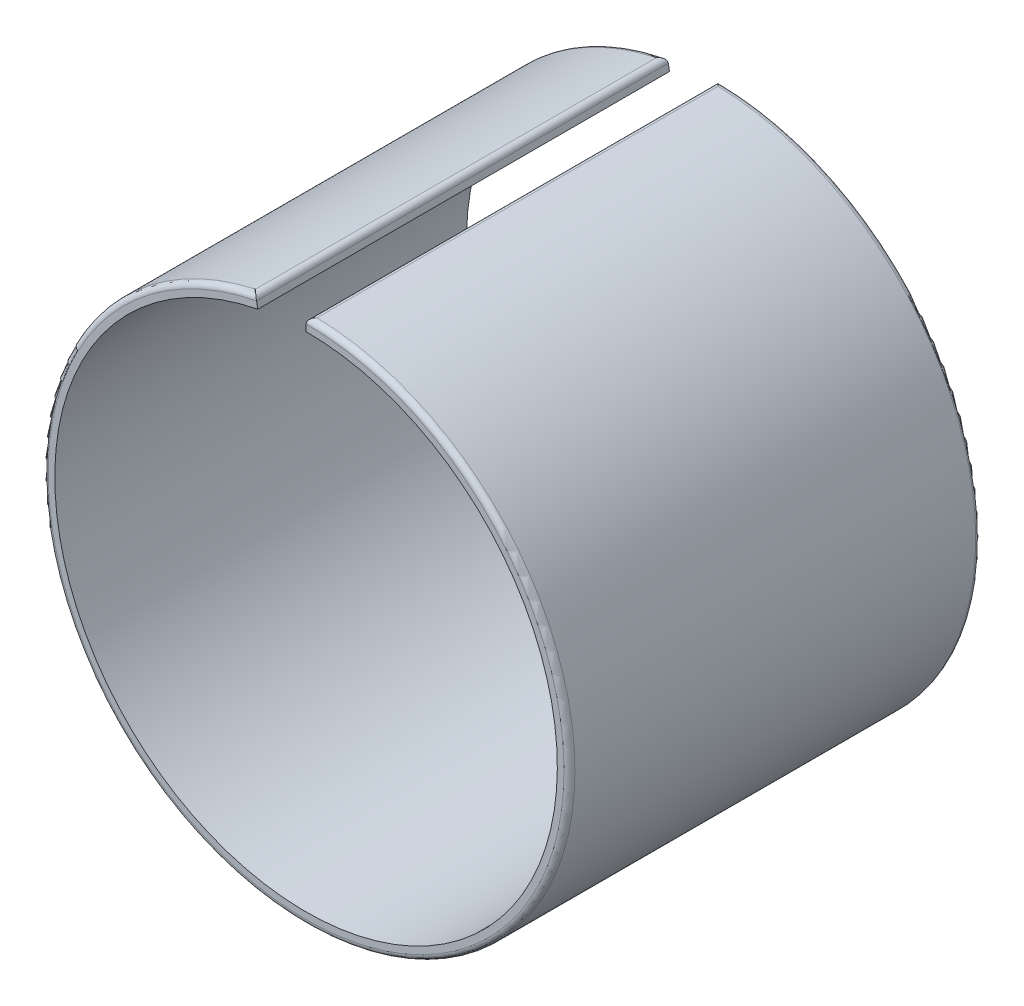
ISO-10303-21;
HEADER;
FILE_DESCRIPTION(('STEP AP214'),'2;1');
FILE_NAME('part.step','',(''),(''),'','','');
FILE_SCHEMA(('AUTOMOTIVE_DESIGN { 1 0 10303 214 1 1 1 1 }'));
ENDSEC;
DATA;
#1=APPLICATION_CONTEXT('core data for automotive mechanical design processes');
#2=APPLICATION_PROTOCOL_DEFINITION('international standard','automotive_design',2000,#1);
#3=PRODUCT_CONTEXT('',#1,'mechanical');
#4=PRODUCT('Part','Part','',(#3));
#5=PRODUCT_RELATED_PRODUCT_CATEGORY('part','',(#4));
#6=PRODUCT_DEFINITION_FORMATION('','',#4);
#7=PRODUCT_DEFINITION_CONTEXT('part definition',#1,'design');
#8=PRODUCT_DEFINITION('design','',#6,#7);
#9=PRODUCT_DEFINITION_SHAPE('','',#8);
#10=(LENGTH_UNIT() NAMED_UNIT(*) SI_UNIT(.MILLI.,.METRE.));
#11=(NAMED_UNIT(*) PLANE_ANGLE_UNIT() SI_UNIT($,.RADIAN.));
#12=(NAMED_UNIT(*) SI_UNIT($,.STERADIAN.) SOLID_ANGLE_UNIT());
#13=UNCERTAINTY_MEASURE_WITH_UNIT(LENGTH_MEASURE(1.E-05),#10,'distance_accuracy_value','');
#14=(GEOMETRIC_REPRESENTATION_CONTEXT(3) GLOBAL_UNCERTAINTY_ASSIGNED_CONTEXT((#13)) GLOBAL_UNIT_ASSIGNED_CONTEXT((#10,
#11,#12)) REPRESENTATION_CONTEXT('',''));
#15=CARTESIAN_POINT('',(0.,0.,0.));
#16=DIRECTION('',(0.,0.,1.));
#17=DIRECTION('',(1.,0.,0.));
#18=AXIS2_PLACEMENT_3D('',#15,#16,#17);
#19=CARTESIAN_POINT('',(0.,0.,34.));
#20=DIRECTION('',(0.,0.,-1.));
#21=DIRECTION('',(-1.,0.,0.));
#22=AXIS2_PLACEMENT_3D('',#19,#20,#21);
#23=CYLINDRICAL_SURFACE('',#22,20.75);
#24=CARTESIAN_POINT('',(0.,0.,0.));
#25=DIRECTION('',(0.,0.,-1.));
#26=DIRECTION('',(1.,0.,0.));
#27=AXIS2_PLACEMENT_3D('',#24,#25,#26);
#28=CIRCLE('',#27,20.75);
#29=CARTESIAN_POINT('',(0.,20.75,0.));
#30=VERTEX_POINT('',#29);
#31=CARTESIAN_POINT('',(-3.98137629924296,20.3644578313253,0.));
#32=VERTEX_POINT('',#31);
#33=EDGE_CURVE('E121',#30,#32,#28,.T.);
#34=ORIENTED_EDGE('',*,*,#33,.T.);
#35=DIRECTION('',(0.,0.,-1.));
#36=VECTOR('',#35,1.);
#37=CARTESIAN_POINT('',(-3.98137629924296,20.3644578313253,34.));
#38=LINE('',#37,#36);
#39=CARTESIAN_POINT('',(-3.98137629924296,20.3644578313253,34.));
#40=VERTEX_POINT('',#39);
#41=EDGE_CURVE('E105',#40,#32,#38,.T.);
#42=ORIENTED_EDGE('',*,*,#41,.F.);
#43=CARTESIAN_POINT('',(0.,0.,34.));
#44=DIRECTION('',(0.,0.,-1.));
#45=DIRECTION('',(1.,0.,0.));
#46=AXIS2_PLACEMENT_3D('',#43,#44,#45);
#47=CIRCLE('',#46,20.75);
#48=CARTESIAN_POINT('',(0.,20.75,34.));
#49=VERTEX_POINT('',#48);
#50=EDGE_CURVE('E110',#49,#40,#47,.T.);
#51=ORIENTED_EDGE('',*,*,#50,.F.);
#52=DIRECTION('',(0.,0.,-1.));
#53=VECTOR('',#52,1.);
#54=CARTESIAN_POINT('',(0.,20.75,34.));
#55=LINE('',#54,#53);
#56=EDGE_CURVE('E123',#49,#30,#55,.T.);
#57=ORIENTED_EDGE('',*,*,#56,.T.);
#58=EDGE_LOOP('',(#34,#42,#51,#57));
#59=FACE_BOUND('',#58,.T.);
#60=ADVANCED_FACE('F32',(#59),#23,.F.);
#61=CARTESIAN_POINT('',(-3.98137629924296,20.3644578313253,34.));
#62=DIRECTION('',(-0.981419654521701,-0.191873556590023,0.));
#63=DIRECTION('',(0.191873556590023,-0.981419654521701,0.));
#64=AXIS2_PLACEMENT_3D('',#61,#62,#63);
#65=PLANE('',#64);
#66=DIRECTION('',(-0.191873556590023,0.981419654521701,0.));
#67=VECTOR('',#66,1.);
#68=CARTESIAN_POINT('',(-3.98137629924296,20.3644578313253,0.));
#69=LINE('',#68,#67);
#70=CARTESIAN_POINT('',(-4.08599457856595,20.8995729215678,0.));
#71=VERTEX_POINT('',#70);
#72=EDGE_CURVE('E197',#32,#71,#69,.T.);
#73=ORIENTED_EDGE('',*,*,#72,.T.);
#74=DIRECTION('',(0.,0.,-1.));
#75=VECTOR('',#74,1.);
#76=CARTESIAN_POINT('',(-4.08599457856595,20.8995729215678,34.));
#77=LINE('',#76,#75);
#78=CARTESIAN_POINT('',(-4.08599457856595,20.8995729215678,34.));
#79=VERTEX_POINT('',#78);
#80=EDGE_CURVE('E108',#71,#79,#77,.F.);
#81=ORIENTED_EDGE('',*,*,#80,.T.);
#82=DIRECTION('',(-0.191873556590023,0.981419654521701,0.));
#83=VECTOR('',#82,1.);
#84=CARTESIAN_POINT('',(-3.98137629924296,20.3644578313253,34.));
#85=LINE('',#84,#83);
#86=EDGE_CURVE('E100',#40,#79,#85,.T.);
#87=ORIENTED_EDGE('',*,*,#86,.F.);
#88=ORIENTED_EDGE('',*,*,#41,.T.);
#89=EDGE_LOOP('',(#73,#81,#87,#88));
#90=FACE_BOUND('',#89,.T.);
#91=ADVANCED_FACE('F103',(#90),#65,.F.);
#92=CARTESIAN_POINT('',(0.,0.,34.));
#93=DIRECTION('',(0.,0.,-1.));
#94=DIRECTION('',(-1.,0.,0.));
#95=AXIS2_PLACEMENT_3D('',#92,#93,#94);
#96=CYLINDRICAL_SURFACE('',#95,21.75);
#97=CARTESIAN_POINT('',(0.,0.,33.55));
#98=DIRECTION('',(0.,0.,1.));
#99=DIRECTION('',(1.,0.,0.));
#100=AXIS2_PLACEMENT_3D('',#97,#98,#99);
#101=CIRCLE('',#100,21.75);
#102=CARTESIAN_POINT('',(0.459507042253521,21.7451455106219,33.55));
#103=VERTEX_POINT('',#102);
#104=CARTESIAN_POINT('',(-4.62328765034932,21.2529459440833,33.55));
#105=VERTEX_POINT('',#104);
#106=EDGE_CURVE('E131',#103,#105,#101,.F.);
#107=ORIENTED_EDGE('',*,*,#106,.T.);
#108=DIRECTION('',(0.,0.,-1.));
#109=VECTOR('',#108,1.);
#110=CARTESIAN_POINT('',(-4.62328765034932,21.2529459440833,34.));
#111=LINE('',#110,#109);
#112=CARTESIAN_POINT('',(-4.62328765034932,21.2529459440833,0.449999999999999));
#113=VERTEX_POINT('',#112);
#114=EDGE_CURVE('E133',#105,#113,#111,.T.);
#115=ORIENTED_EDGE('',*,*,#114,.T.);
#116=CARTESIAN_POINT('',(0.,0.,0.449999999999999));
#117=DIRECTION('',(0.,0.,1.));
#118=DIRECTION('',(1.,0.,0.));
#119=AXIS2_PLACEMENT_3D('',#116,#117,#118);
#120=CIRCLE('',#119,21.75);
#121=CARTESIAN_POINT('',(0.459507042253521,21.7451455106219,0.449999999999999));
#122=VERTEX_POINT('',#121);
#123=EDGE_CURVE('E122',#113,#122,#120,.T.);
#124=ORIENTED_EDGE('',*,*,#123,.T.);
#125=DIRECTION('',(0.,0.,-1.));
#126=VECTOR('',#125,1.);
#127=CARTESIAN_POINT('',(0.459507042253521,21.7451455106219,34.));
#128=LINE('',#127,#126);
#129=EDGE_CURVE('E125',#122,#103,#128,.F.);
#130=ORIENTED_EDGE('',*,*,#129,.T.);
#131=EDGE_LOOP('',(#107,#115,#124,#130));
#132=FACE_BOUND('',#131,.T.);
#133=ADVANCED_FACE('F203',(#132),#96,.T.);
#134=CARTESIAN_POINT('',(0.,20.75,34.));
#135=DIRECTION('',(1.,0.,0.));
#136=DIRECTION('',(0.,0.,-1.));
#137=AXIS2_PLACEMENT_3D('',#134,#135,#136);
#138=PLANE('',#137);
#139=DIRECTION('',(0.,-1.,0.));
#140=VECTOR('',#139,1.);
#141=CARTESIAN_POINT('',(0.,20.75,34.));
#142=LINE('',#141,#140);
#143=CARTESIAN_POINT('',(0.,21.2952459483332,34.));
#144=VERTEX_POINT('',#143);
#145=EDGE_CURVE('E109',#144,#49,#142,.T.);
#146=ORIENTED_EDGE('',*,*,#145,.F.);
#147=DIRECTION('',(0.,0.,-1.));
#148=VECTOR('',#147,1.);
#149=CARTESIAN_POINT('',(0.,21.2952459483332,34.));
#150=LINE('',#149,#148);
#151=CARTESIAN_POINT('',(0.,21.2952459483332,0.));
#152=VERTEX_POINT('',#151);
#153=EDGE_CURVE('E11',#144,#152,#150,.T.);
#154=ORIENTED_EDGE('',*,*,#153,.T.);
#155=DIRECTION('',(0.,-1.,0.));
#156=VECTOR('',#155,1.);
#157=CARTESIAN_POINT('',(0.,20.75,0.));
#158=LINE('',#157,#156);
#159=EDGE_CURVE('E118',#152,#30,#158,.T.);
#160=ORIENTED_EDGE('',*,*,#159,.T.);
#161=ORIENTED_EDGE('',*,*,#56,.F.);
#162=EDGE_LOOP('',(#146,#154,#160,#161));
#163=FACE_BOUND('',#162,.T.);
#164=ADVANCED_FACE('F192',(#163),#138,.F.);
#165=CARTESIAN_POINT('',(0.,0.,34.));
#166=DIRECTION('',(0.,0.,1.));
#167=DIRECTION('',(1.,0.,0.));
#168=AXIS2_PLACEMENT_3D('',#165,#166,#167);
#169=PLANE('',#168);
#170=ORIENTED_EDGE('',*,*,#86,.T.);
#171=CARTESIAN_POINT('',(-4.52763342310071,20.8132298211023,34.));
#172=DIRECTION('',(0.,0.,1.));
#173=DIRECTION('',(1.,0.,0.));
#174=AXIS2_PLACEMENT_3D('',#171,#172,#173);
#175=CIRCLE('',#174,0.45);
#176=CARTESIAN_POINT('',(-4.08693140168856,20.9042338227903,34.));
#177=VERTEX_POINT('',#176);
#178=EDGE_CURVE('E46',#79,#177,#175,.T.);
#179=ORIENTED_EDGE('',*,*,#178,.T.);
#180=CARTESIAN_POINT('',(0.,0.,34.));
#181=DIRECTION('',(0.,0.,1.));
#182=DIRECTION('',(1.,0.,0.));
#183=AXIS2_PLACEMENT_3D('',#180,#181,#182);
#184=CIRCLE('',#183,21.3);
#185=CARTESIAN_POINT('',(2.51129308550044E-05,21.2999999999852,34.));
#186=VERTEX_POINT('',#185);
#187=EDGE_CURVE('E57',#177,#186,#184,.T.);
#188=ORIENTED_EDGE('',*,*,#187,.T.);
#189=CARTESIAN_POINT('',(0.45,21.2952459483332,34.));
#190=DIRECTION('',(0.,0.,1.));
#191=DIRECTION('',(1.,0.,0.));
#192=AXIS2_PLACEMENT_3D('',#189,#190,#191);
#193=CIRCLE('',#192,0.45);
#194=EDGE_CURVE('E143',#186,#144,#193,.T.);
#195=ORIENTED_EDGE('',*,*,#194,.T.);
#196=ORIENTED_EDGE('',*,*,#145,.T.);
#197=ORIENTED_EDGE('',*,*,#50,.T.);
#198=EDGE_LOOP('',(#170,#179,#188,#195,#196,#197));
#199=FACE_BOUND('',#198,.T.);
#200=ADVANCED_FACE('F113',(#199),#169,.T.);
#201=CARTESIAN_POINT('',(0.,0.,0.));
#202=DIRECTION('',(0.,0.,1.));
#203=DIRECTION('',(1.,0.,0.));
#204=AXIS2_PLACEMENT_3D('',#201,#202,#203);
#205=PLANE('',#204);
#206=CARTESIAN_POINT('',(0.,0.,0.));
#207=DIRECTION('',(0.,0.,1.));
#208=DIRECTION('',(1.,0.,0.));
#209=AXIS2_PLACEMENT_3D('',#206,#207,#208);
#210=CIRCLE('',#209,21.3);
#211=CARTESIAN_POINT('',(2.51129308550044E-05,21.2999999999852,0.));
#212=VERTEX_POINT('',#211);
#213=CARTESIAN_POINT('',(-4.08693140168856,20.9042338227903,0.));
#214=VERTEX_POINT('',#213);
#215=EDGE_CURVE('E136',#212,#214,#210,.F.);
#216=ORIENTED_EDGE('',*,*,#215,.T.);
#217=CARTESIAN_POINT('',(-4.52763342310071,20.8132298211023,0.));
#218=DIRECTION('',(0.,0.,1.));
#219=DIRECTION('',(1.,0.,0.));
#220=AXIS2_PLACEMENT_3D('',#217,#218,#219);
#221=CIRCLE('',#220,0.45);
#222=EDGE_CURVE('E140',#214,#71,#221,.F.);
#223=ORIENTED_EDGE('',*,*,#222,.T.);
#224=ORIENTED_EDGE('',*,*,#72,.F.);
#225=ORIENTED_EDGE('',*,*,#33,.F.);
#226=ORIENTED_EDGE('',*,*,#159,.F.);
#227=CARTESIAN_POINT('',(0.45,21.2952459483332,0.));
#228=DIRECTION('',(0.,0.,1.));
#229=DIRECTION('',(1.,0.,0.));
#230=AXIS2_PLACEMENT_3D('',#227,#228,#229);
#231=CIRCLE('',#230,0.45);
#232=EDGE_CURVE('E138',#152,#212,#231,.F.);
#233=ORIENTED_EDGE('',*,*,#232,.T.);
#234=EDGE_LOOP('',(#216,#223,#224,#225,#226,#233));
#235=FACE_BOUND('',#234,.T.);
#236=ADVANCED_FACE('F199',(#235),#205,.F.);
#237=CARTESIAN_POINT('',(0.45,21.2952459483332,34.));
#238=DIRECTION('',(0.,0.,-1.));
#239=DIRECTION('',(-1.,0.,0.));
#240=AXIS2_PLACEMENT_3D('',#237,#238,#239);
#241=CYLINDRICAL_SURFACE('',#240,0.45);
#242=ORIENTED_EDGE('',*,*,#153,.F.);
#243=ORIENTED_EDGE('',*,*,#194,.F.);
#244=CARTESIAN_POINT('',(2.51129308550044E-05,21.2999999999852,34.));
#245=CARTESIAN_POINT('',(0.000205080424269829,21.3202502417731,34.0000334832507));
#246=CARTESIAN_POINT('',(0.00181696299777287,21.3404325359598,33.9986354645026));
#247=CARTESIAN_POINT('',(0.00759872869582896,21.3799045347419,33.9932832073745));
#248=CARTESIAN_POINT('',(0.0117462105791799,21.3992004824243,33.9893513385021));
#249=CARTESIAN_POINT('',(0.0222914549653311,21.4364632335712,33.9792430574387));
#250=CARTESIAN_POINT('',(0.0286828209684085,21.4544336412858,33.9730730237996));
#251=CARTESIAN_POINT('',(0.0433383704814814,21.4888345230947,33.9588677815102));
#252=CARTESIAN_POINT('',(0.0516068146869002,21.5052613716974,33.9508283285247));
#253=CARTESIAN_POINT('',(0.073322530895949,21.5427448700066,33.9296724364376));
#254=CARTESIAN_POINT('',(0.0875070441805964,21.5629597978578,33.915822225454));
#255=CARTESIAN_POINT('',(0.117985588156515,21.5999476155502,33.8860212830595));
#256=CARTESIAN_POINT('',(0.134283520784072,21.6167139865604,33.8700666653931));
#257=CARTESIAN_POINT('',(0.174775451678142,21.6526464586891,33.8303924000465));
#258=CARTESIAN_POINT('',(0.199630294709399,21.6703352894032,33.806012525735));
#259=CARTESIAN_POINT('',(0.250993017452138,21.6999390100549,33.7555778432692));
#260=CARTESIAN_POINT('',(0.277502849498397,21.7118469294308,33.7295210557549));
#261=CARTESIAN_POINT('',(0.329348795924076,21.7295673078622,33.6784988495765));
#262=CARTESIAN_POINT('',(0.35462024895406,21.7357753533961,33.653601737457));
#263=CARTESIAN_POINT('',(0.405436258118273,21.7437698734261,33.603468283826));
#264=CARTESIAN_POINT('',(0.43098013812847,21.7455655032285,33.5782327541458));
#265=CARTESIAN_POINT('',(0.457475905138596,21.7451849877105,33.5520103922595));
#266=CARTESIAN_POINT('',(0.458491531583518,21.7451669655078,33.5510051747432));
#267=CARTESIAN_POINT('',(0.459507042253521,21.7451455106219,33.55));
#268=B_SPLINE_CURVE_WITH_KNOTS('',3,(#244,#245,#246,#247,#248,#249,#250,#251,#252,#253,#254,
#255,#256,#257,#258,#259,#260,#261,#262,#263,#264,#265,#266,#267),.UNSPECIFIED.,.F.,.F.,(4,2,2,
2,2,2,2,2,2,2,2,4),(0.,0.0605732287088322,0.12061889334988,0.180494761096977,0.240507921926082,
0.324980453396992,0.409611225386809,0.526139377937133,0.64280769204515,0.750578928975459,
0.858126362209593,0.862413597700414),.UNSPECIFIED.);
#269=EDGE_CURVE('E37',#103,#186,#268,.F.);
#270=ORIENTED_EDGE('',*,*,#269,.F.);
#271=ORIENTED_EDGE('',*,*,#129,.F.);
#272=CARTESIAN_POINT('',(2.51129308550044E-05,21.2999999999852,0.));
#273=CARTESIAN_POINT('',(0.000205080424270105,21.3202502417731,-3.34832507142784E-05));
#274=CARTESIAN_POINT('',(0.00181696299777311,21.3404325359598,0.00136453549741272));
#275=CARTESIAN_POINT('',(0.00759872869582902,21.3799045347419,0.00671679262545418));
#276=CARTESIAN_POINT('',(0.0117462105791799,21.3992004824243,0.0106486614979461));
#277=CARTESIAN_POINT('',(0.022291454965331,21.4364632335712,0.0207569425612667));
#278=CARTESIAN_POINT('',(0.0286828209684086,21.4544336412858,0.0269269762004245));
#279=CARTESIAN_POINT('',(0.0433383704814815,21.4888345230947,0.0411322184898392));
#280=CARTESIAN_POINT('',(0.0516068146869002,21.5052613716974,0.0491716714752613));
#281=CARTESIAN_POINT('',(0.0733225308959483,21.5427448700066,0.0703275635624218));
#282=CARTESIAN_POINT('',(0.0875070441805947,21.5629597978578,0.0841777745460159));
#283=CARTESIAN_POINT('',(0.117985588156513,21.5999476155502,0.113978716940482));
#284=CARTESIAN_POINT('',(0.13428352078407,21.6167139865604,0.129933334606921));
#285=CARTESIAN_POINT('',(0.174775451678141,21.6526464586891,0.169607599953455));
#286=CARTESIAN_POINT('',(0.1996302947094,21.6703352894032,0.193987474265015));
#287=CARTESIAN_POINT('',(0.250993017452136,21.6999390100549,0.244422156730792));
#288=CARTESIAN_POINT('',(0.27750284949839,21.7118469294308,0.270478944245139));
#289=CARTESIAN_POINT('',(0.329348795924082,21.7295673078622,0.321501150423493));
#290=CARTESIAN_POINT('',(0.354620248954083,21.7357753533961,0.346398262542984));
#291=CARTESIAN_POINT('',(0.405436258118262,21.7437698734261,0.396531716173975));
#292=CARTESIAN_POINT('',(0.430980138128409,21.7455655032285,0.421767245854291));
#293=CARTESIAN_POINT('',(0.457475905138591,21.7451849877105,0.447989607740514));
#294=CARTESIAN_POINT('',(0.458491531583515,21.7451669655078,0.448994825256828));
#295=CARTESIAN_POINT('',(0.459507042253521,21.7451455106219,0.449999999999999));
#296=B_SPLINE_CURVE_WITH_KNOTS('',3,(#272,#273,#274,#275,#276,#277,#278,#279,#280,#281,#282,
#283,#284,#285,#286,#287,#288,#289,#290,#291,#292,#293,#294,#295),.UNSPECIFIED.,.F.,.F.,(4,2,2,
2,2,2,2,2,2,2,2,4),(0.,0.0605732287088322,0.12061889334988,0.180494761096976,0.24050792192608,
0.324980453396989,0.409611225386808,0.526139377937128,0.642807692045149,0.750578928975455,
0.858126362209591,0.862413597700414),.UNSPECIFIED.);
#297=EDGE_CURVE('E170',#212,#122,#296,.T.);
#298=ORIENTED_EDGE('',*,*,#297,.F.);
#299=ORIENTED_EDGE('',*,*,#232,.F.);
#300=EDGE_LOOP('',(#242,#243,#270,#271,#298,#299));
#301=FACE_BOUND('',#300,.T.);
#302=ADVANCED_FACE('F34',(#301),#241,.T.);
#303=CARTESIAN_POINT('',(0.,0.,33.55));
#304=DIRECTION('',(0.,0.,1.));
#305=DIRECTION('',(1.,0.,0.));
#306=AXIS2_PLACEMENT_3D('',#303,#304,#305);
#307=TOROIDAL_SURFACE('',#306,21.3,0.45);
#308=ORIENTED_EDGE('',*,*,#269,.T.);
#309=ORIENTED_EDGE('',*,*,#187,.F.);
#310=CARTESIAN_POINT('',(-4.08693140168856,20.9042338227903,34.));
#311=CARTESIAN_POINT('',(-4.09099351123743,20.9240732770868,34.0000334832507));
#312=CARTESIAN_POINT('',(-4.09644789304158,20.9435712996327,33.9986354645026));
#313=CARTESIAN_POINT('',(-4.10969586432753,20.9812005270929,33.9932832073745));
#314=CARTESIAN_POINT('',(-4.11746866667422,20.9993421573012,33.9893513385021));
#315=CARTESIAN_POINT('',(-4.13496771336741,21.0338892001128,33.9792430574387));
#316=CARTESIAN_POINT('',(-4.14468837162365,21.0502993773172,33.9730730237996));
#317=CARTESIAN_POINT('',(-4.1656722355061,21.0812490664485,33.9588677815102));
#318=CARTESIAN_POINT('',(-4.17693892702658,21.0957842027318,33.9508283285247));
#319=CARTESIAN_POINT('',(-4.20544324986018,21.1284045729898,33.9296724364376));
#320=CARTESIAN_POINT('',(-4.22324292009057,21.1455222674853,33.915822225454));
#321=CARTESIAN_POINT('',(-4.2602521463209,21.1759748121142,33.8860212830595));
#322=CARTESIAN_POINT('',(-4.27946428096651,21.1893025158603,33.8700666653931));
#323=CARTESIAN_POINT('',(-4.32609834901985,21.2167980194491,33.8303924000465));
#324=CARTESIAN_POINT('',(-4.35388539934176,21.2293891984465,33.8060125257349));
#325=CARTESIAN_POINT('',(-4.40997395612111,21.2485877234522,33.7555778432693));
#326=CARTESIAN_POINT('',(-4.43827604117185,21.2551878538129,33.7295210557552));
#327=CARTESIAN_POINT('',(-4.49255874403448,21.2626311153556,33.6784988495762));
#328=CARTESIAN_POINT('',(-4.5185518045118,21.2638748896858,33.653601737456));
#329=CARTESIAN_POINT('',(-4.56995757166323,21.2619706203614,33.603468283827));
#330=CARTESIAN_POINT('',(-4.59537137143707,21.2588316916344,33.5782327541494));
#331=CARTESIAN_POINT('',(-4.62130182707339,21.2533744091761,33.5520103922598));
#332=CARTESIAN_POINT('',(-4.62229512484381,21.253161849974,33.5510051747433));
#333=CARTESIAN_POINT('',(-4.62328765034932,21.2529459440833,33.55));
#334=B_SPLINE_CURVE_WITH_KNOTS('',3,(#310,#311,#312,#313,#314,#315,#316,#317,#318,#319,#320,
#321,#322,#323,#324,#325,#326,#327,#328,#329,#330,#331,#332,#333),.UNSPECIFIED.,.F.,.F.,(4,2,2,
2,2,2,2,2,2,2,2,4),(0.,0.0605732287088325,0.120618893349879,0.180494761096977,0.24050792192608,
0.32498045339699,0.409611225386809,0.526139377937136,0.64280769204515,0.750578928975455,
0.858126362209595,0.862413597700414),.UNSPECIFIED.);
#335=EDGE_CURVE('E155',#105,#177,#334,.F.);
#336=ORIENTED_EDGE('',*,*,#335,.F.);
#337=ORIENTED_EDGE('',*,*,#106,.F.);
#338=EDGE_LOOP('',(#308,#309,#336,#337));
#339=FACE_BOUND('',#338,.T.);
#340=ADVANCED_FACE('F166',(#339),#307,.T.);
#341=CARTESIAN_POINT('',(0.,0.,0.449999999999999));
#342=DIRECTION('',(0.,0.,1.));
#343=DIRECTION('',(1.,0.,0.));
#344=AXIS2_PLACEMENT_3D('',#341,#342,#343);
#345=TOROIDAL_SURFACE('',#344,21.3,0.45);
#346=ORIENTED_EDGE('',*,*,#297,.T.);
#347=ORIENTED_EDGE('',*,*,#123,.F.);
#348=CARTESIAN_POINT('',(-4.08693140168856,20.9042338227903,0.));
#349=CARTESIAN_POINT('',(-4.09099351123743,20.9240732770868,-3.34832507135321E-05));
#350=CARTESIAN_POINT('',(-4.09644789304158,20.9435712996327,0.00136453549741317));
#351=CARTESIAN_POINT('',(-4.10969586432753,20.9812005270929,0.00671679262545383));
#352=CARTESIAN_POINT('',(-4.11746866667422,20.9993421573012,0.0106486614979452));
#353=CARTESIAN_POINT('',(-4.13496771336741,21.0338892001128,0.0207569425612667));
#354=CARTESIAN_POINT('',(-4.14468837162365,21.0502993773172,0.0269269762004261));
#355=CARTESIAN_POINT('',(-4.1656722355061,21.0812490664485,0.041132218489841));
#356=CARTESIAN_POINT('',(-4.17693892702658,21.0957842027318,0.0491716714752616));
#357=CARTESIAN_POINT('',(-4.20544324986018,21.1284045729898,0.0703275635624218));
#358=CARTESIAN_POINT('',(-4.22324292009057,21.1455222674853,0.0841777745460184));
#359=CARTESIAN_POINT('',(-4.2602521463209,21.1759748121142,0.113978716940477));
#360=CARTESIAN_POINT('',(-4.27946428096651,21.1893025158603,0.129933334606907));
#361=CARTESIAN_POINT('',(-4.32609834901985,21.2167980194491,0.169607599953475));
#362=CARTESIAN_POINT('',(-4.35388539934176,21.2293891984466,0.193987474265101));
#363=CARTESIAN_POINT('',(-4.40997395612112,21.2485877234522,0.244422156730705));
#364=CARTESIAN_POINT('',(-4.43827604117187,21.2551878538129,0.270478944244812));
#365=CARTESIAN_POINT('',(-4.49255874403446,21.2626311153556,0.321501150423789));
#366=CARTESIAN_POINT('',(-4.51855180451173,21.2638748896858,0.34639826254406));
#367=CARTESIAN_POINT('',(-4.56995757166331,21.2619706203613,0.396531716172883));
#368=CARTESIAN_POINT('',(-4.59537137143736,21.2588316916344,0.421767245850259));
#369=CARTESIAN_POINT('',(-4.62130182707341,21.2533744091761,0.447989607740197));
#370=CARTESIAN_POINT('',(-4.62229512484382,21.253161849974,0.448994825256665));
#371=CARTESIAN_POINT('',(-4.62328765034932,21.2529459440833,0.449999999999999));
#372=B_SPLINE_CURVE_WITH_KNOTS('',3,(#348,#349,#350,#351,#352,#353,#354,#355,#356,#357,#358,
#359,#360,#361,#362,#363,#364,#365,#366,#367,#368,#369,#370,#371),.UNSPECIFIED.,.F.,.F.,(4,2,2,
2,2,2,2,2,2,2,2,4),(0.,0.0605732287088326,0.120618893349879,0.180494761096977,0.240507921926078,
0.324980453396989,0.409611225386809,0.526139377937135,0.642807692045153,0.750578928975454,
0.85812636220959,0.862413597700414),.UNSPECIFIED.);
#373=EDGE_CURVE('E147',#214,#113,#372,.T.);
#374=ORIENTED_EDGE('',*,*,#373,.F.);
#375=ORIENTED_EDGE('',*,*,#215,.F.);
#376=EDGE_LOOP('',(#346,#347,#374,#375));
#377=FACE_BOUND('',#376,.T.);
#378=ADVANCED_FACE('F163',(#377),#345,.T.);
#379=CARTESIAN_POINT('',(-4.52763342310071,20.8132298211023,34.));
#380=DIRECTION('',(0.,0.,-1.));
#381=DIRECTION('',(-1.,0.,0.));
#382=AXIS2_PLACEMENT_3D('',#379,#380,#381);
#383=CYLINDRICAL_SURFACE('',#382,0.45);
#384=ORIENTED_EDGE('',*,*,#178,.F.);
#385=ORIENTED_EDGE('',*,*,#80,.F.);
#386=ORIENTED_EDGE('',*,*,#222,.F.);
#387=ORIENTED_EDGE('',*,*,#373,.T.);
#388=ORIENTED_EDGE('',*,*,#114,.F.);
#389=ORIENTED_EDGE('',*,*,#335,.T.);
#390=EDGE_LOOP('',(#384,#385,#386,#387,#388,#389));
#391=FACE_BOUND('',#390,.T.);
#392=ADVANCED_FACE('F160',(#391),#383,.T.);
#393=CLOSED_SHELL('',(#60,#91,#133,#164,#200,#236,#302,#340,#378,#392));
#394=MANIFOLD_SOLID_BREP('B2',#393);
#395=ADVANCED_BREP_SHAPE_REPRESENTATION('',(#18,#394),#14);
#396=SHAPE_DEFINITION_REPRESENTATION(#9,#395);
ENDSEC;
END-ISO-10303-21;
